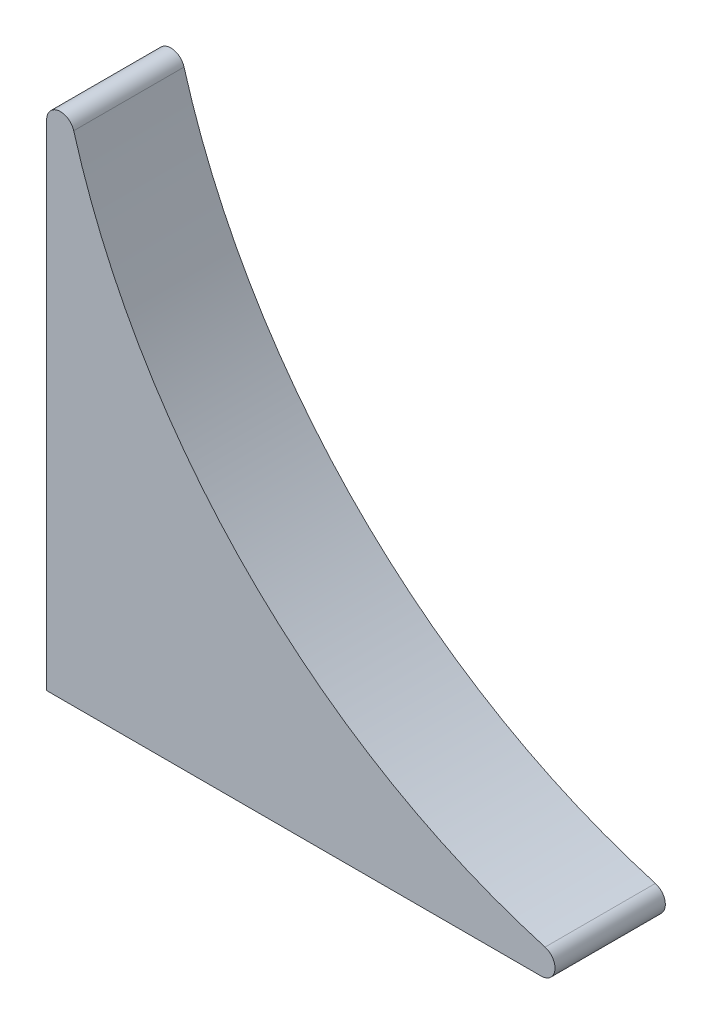
ISO-10303-21;
HEADER;
FILE_DESCRIPTION(('STEP AP214'),'2;1');
FILE_NAME('part.step','',(''),(''),'','','');
FILE_SCHEMA(('AUTOMOTIVE_DESIGN { 1 0 10303 214 1 1 1 1 }'));
ENDSEC;
DATA;
#1=APPLICATION_CONTEXT('core data for automotive mechanical design processes');
#2=APPLICATION_PROTOCOL_DEFINITION('international standard','automotive_design',2000,#1);
#3=PRODUCT_CONTEXT('',#1,'mechanical');
#4=PRODUCT('Part','Part','',(#3));
#5=PRODUCT_RELATED_PRODUCT_CATEGORY('part','',(#4));
#6=PRODUCT_DEFINITION_FORMATION('','',#4);
#7=PRODUCT_DEFINITION_CONTEXT('part definition',#1,'design');
#8=PRODUCT_DEFINITION('design','',#6,#7);
#9=PRODUCT_DEFINITION_SHAPE('','',#8);
#10=(LENGTH_UNIT() NAMED_UNIT(*) SI_UNIT(.MILLI.,.METRE.));
#11=(NAMED_UNIT(*) PLANE_ANGLE_UNIT() SI_UNIT($,.RADIAN.));
#12=(NAMED_UNIT(*) SI_UNIT($,.STERADIAN.) SOLID_ANGLE_UNIT());
#13=UNCERTAINTY_MEASURE_WITH_UNIT(LENGTH_MEASURE(1.E-05),#10,'distance_accuracy_value','');
#14=(GEOMETRIC_REPRESENTATION_CONTEXT(3) GLOBAL_UNCERTAINTY_ASSIGNED_CONTEXT((#13)) GLOBAL_UNIT_ASSIGNED_CONTEXT((#10,
#11,#12)) REPRESENTATION_CONTEXT('',''));
#15=CARTESIAN_POINT('',(0.,0.,0.));
#16=DIRECTION('',(0.,0.,1.));
#17=DIRECTION('',(1.,0.,0.));
#18=AXIS2_PLACEMENT_3D('',#15,#16,#17);
#19=CARTESIAN_POINT('',(0.,0.,4.));
#20=DIRECTION('',(1.,0.,0.));
#21=DIRECTION('',(0.,0.,-1.));
#22=AXIS2_PLACEMENT_3D('',#19,#20,#21);
#23=PLANE('',#22);
#24=DIRECTION('',(0.,-1.,0.));
#25=VECTOR('',#24,1.);
#26=CARTESIAN_POINT('',(0.,0.,4.));
#27=LINE('',#26,#25);
#28=CARTESIAN_POINT('',(0.,17.9289321881345,4.));
#29=VERTEX_POINT('',#28);
#30=CARTESIAN_POINT('',(0.,0.,4.));
#31=VERTEX_POINT('',#30);
#32=EDGE_CURVE('E82',#29,#31,#27,.T.);
#33=ORIENTED_EDGE('',*,*,#32,.F.);
#34=DIRECTION('',(0.,0.,-1.));
#35=VECTOR('',#34,1.);
#36=CARTESIAN_POINT('',(0.,17.9289321881345,4.));
#37=LINE('',#36,#35);
#38=CARTESIAN_POINT('',(0.,17.9289321881345,0.));
#39=VERTEX_POINT('',#38);
#40=EDGE_CURVE('E11',#29,#39,#37,.T.);
#41=ORIENTED_EDGE('',*,*,#40,.T.);
#42=DIRECTION('',(0.,-1.,0.));
#43=VECTOR('',#42,1.);
#44=CARTESIAN_POINT('',(0.,0.,0.));
#45=LINE('',#44,#43);
#46=CARTESIAN_POINT('',(0.,0.,0.));
#47=VERTEX_POINT('',#46);
#48=EDGE_CURVE('E97',#39,#47,#45,.T.);
#49=ORIENTED_EDGE('',*,*,#48,.T.);
#50=DIRECTION('',(0.,0.,-1.));
#51=VECTOR('',#50,1.);
#52=CARTESIAN_POINT('',(0.,0.,4.));
#53=LINE('',#52,#51);
#54=EDGE_CURVE('E93',#31,#47,#53,.T.);
#55=ORIENTED_EDGE('',*,*,#54,.F.);
#56=EDGE_LOOP('',(#33,#41,#49,#55));
#57=FACE_BOUND('',#56,.T.);
#58=ADVANCED_FACE('F35',(#57),#23,.F.);
#59=CARTESIAN_POINT('',(0.,0.,4.));
#60=DIRECTION('',(0.,1.,0.));
#61=DIRECTION('',(-1.,0.,0.));
#62=AXIS2_PLACEMENT_3D('',#59,#60,#61);
#63=PLANE('',#62);
#64=DIRECTION('',(1.,0.,0.));
#65=VECTOR('',#64,1.);
#66=CARTESIAN_POINT('',(0.,0.,0.));
#67=LINE('',#66,#65);
#68=CARTESIAN_POINT('',(17.9289321881345,0.,0.));
#69=VERTEX_POINT('',#68);
#70=EDGE_CURVE('E125',#47,#69,#67,.T.);
#71=ORIENTED_EDGE('',*,*,#70,.T.);
#72=DIRECTION('',(0.,0.,-1.));
#73=VECTOR('',#72,1.);
#74=CARTESIAN_POINT('',(17.9289321881345,0.,4.));
#75=LINE('',#74,#73);
#76=CARTESIAN_POINT('',(17.9289321881345,0.,4.));
#77=VERTEX_POINT('',#76);
#78=EDGE_CURVE('E58',#69,#77,#75,.F.);
#79=ORIENTED_EDGE('',*,*,#78,.T.);
#80=DIRECTION('',(1.,0.,0.));
#81=VECTOR('',#80,1.);
#82=CARTESIAN_POINT('',(0.,0.,4.));
#83=LINE('',#82,#81);
#84=EDGE_CURVE('E84',#31,#77,#83,.T.);
#85=ORIENTED_EDGE('',*,*,#84,.F.);
#86=ORIENTED_EDGE('',*,*,#54,.T.);
#87=EDGE_LOOP('',(#71,#79,#85,#86));
#88=FACE_BOUND('',#87,.T.);
#89=ADVANCED_FACE('F92',(#88),#63,.F.);
#90=CARTESIAN_POINT('',(25.,25.,4.));
#91=DIRECTION('',(0.,0.,-1.));
#92=DIRECTION('',(-1.,0.,0.));
#93=AXIS2_PLACEMENT_3D('',#90,#91,#92);
#94=CYLINDRICAL_SURFACE('',#93,25.);
#95=CARTESIAN_POINT('',(25.,25.,4.));
#96=DIRECTION('',(0.,0.,-1.));
#97=DIRECTION('',(1.,0.,0.));
#98=AXIS2_PLACEMENT_3D('',#95,#96,#97);
#99=CIRCLE('',#98,25.);
#100=CARTESIAN_POINT('',(18.0675805766025,0.980392156862745,4.));
#101=VERTEX_POINT('',#100);
#102=CARTESIAN_POINT('',(0.980392156862745,18.0675805766025,4.));
#103=VERTEX_POINT('',#102);
#104=EDGE_CURVE('E94',#101,#103,#99,.T.);
#105=ORIENTED_EDGE('',*,*,#104,.F.);
#106=DIRECTION('',(0.,0.,-1.));
#107=VECTOR('',#106,1.);
#108=CARTESIAN_POINT('',(18.0675805766025,0.980392156862745,4.));
#109=LINE('',#108,#107);
#110=CARTESIAN_POINT('',(18.0675805766025,0.980392156862745,0.));
#111=VERTEX_POINT('',#110);
#112=EDGE_CURVE('E101',#101,#111,#109,.T.);
#113=ORIENTED_EDGE('',*,*,#112,.T.);
#114=CARTESIAN_POINT('',(25.,25.,0.));
#115=DIRECTION('',(0.,0.,-1.));
#116=DIRECTION('',(1.,0.,0.));
#117=AXIS2_PLACEMENT_3D('',#114,#115,#116);
#118=CIRCLE('',#117,25.);
#119=CARTESIAN_POINT('',(0.980392156862745,18.0675805766025,0.));
#120=VERTEX_POINT('',#119);
#121=EDGE_CURVE('E89',#111,#120,#118,.T.);
#122=ORIENTED_EDGE('',*,*,#121,.T.);
#123=DIRECTION('',(0.,0.,-1.));
#124=VECTOR('',#123,1.);
#125=CARTESIAN_POINT('',(0.980392156862745,18.0675805766025,4.));
#126=LINE('',#125,#124);
#127=EDGE_CURVE('E99',#120,#103,#126,.F.);
#128=ORIENTED_EDGE('',*,*,#127,.T.);
#129=EDGE_LOOP('',(#105,#113,#122,#128));
#130=FACE_BOUND('',#129,.T.);
#131=ADVANCED_FACE('F118',(#130),#94,.F.);
#132=CARTESIAN_POINT('',(25.,25.,4.));
#133=DIRECTION('',(0.,0.,1.));
#134=DIRECTION('',(1.,0.,0.));
#135=AXIS2_PLACEMENT_3D('',#132,#133,#134);
#136=PLANE('',#135);
#137=ORIENTED_EDGE('',*,*,#84,.T.);
#138=CARTESIAN_POINT('',(17.9289321881345,0.5,4.));
#139=DIRECTION('',(0.,0.,1.));
#140=DIRECTION('',(1.,0.,0.));
#141=AXIS2_PLACEMENT_3D('',#138,#139,#140);
#142=CIRCLE('',#141,0.5);
#143=EDGE_CURVE('E43',#77,#101,#142,.T.);
#144=ORIENTED_EDGE('',*,*,#143,.T.);
#145=ORIENTED_EDGE('',*,*,#104,.T.);
#146=CARTESIAN_POINT('',(0.5,17.9289321881345,4.));
#147=DIRECTION('',(0.,0.,1.));
#148=DIRECTION('',(1.,0.,0.));
#149=AXIS2_PLACEMENT_3D('',#146,#147,#148);
#150=CIRCLE('',#149,0.5);
#151=EDGE_CURVE('E50',#103,#29,#150,.T.);
#152=ORIENTED_EDGE('',*,*,#151,.T.);
#153=ORIENTED_EDGE('',*,*,#32,.T.);
#154=EDGE_LOOP('',(#137,#144,#145,#152,#153));
#155=FACE_BOUND('',#154,.T.);
#156=ADVANCED_FACE('F83',(#155),#136,.T.);
#157=CARTESIAN_POINT('',(25.,25.,0.));
#158=DIRECTION('',(0.,0.,1.));
#159=DIRECTION('',(1.,0.,0.));
#160=AXIS2_PLACEMENT_3D('',#157,#158,#159);
#161=PLANE('',#160);
#162=ORIENTED_EDGE('',*,*,#121,.F.);
#163=CARTESIAN_POINT('',(17.9289321881345,0.5,0.));
#164=DIRECTION('',(0.,0.,1.));
#165=DIRECTION('',(1.,0.,0.));
#166=AXIS2_PLACEMENT_3D('',#163,#164,#165);
#167=CIRCLE('',#166,0.5);
#168=EDGE_CURVE('E111',#111,#69,#167,.F.);
#169=ORIENTED_EDGE('',*,*,#168,.T.);
#170=ORIENTED_EDGE('',*,*,#70,.F.);
#171=ORIENTED_EDGE('',*,*,#48,.F.);
#172=CARTESIAN_POINT('',(0.5,17.9289321881345,0.));
#173=DIRECTION('',(0.,0.,1.));
#174=DIRECTION('',(1.,0.,0.));
#175=AXIS2_PLACEMENT_3D('',#172,#173,#174);
#176=CIRCLE('',#175,0.5);
#177=EDGE_CURVE('E109',#39,#120,#176,.F.);
#178=ORIENTED_EDGE('',*,*,#177,.T.);
#179=EDGE_LOOP('',(#162,#169,#170,#171,#178));
#180=FACE_BOUND('',#179,.T.);
#181=ADVANCED_FACE('F124',(#180),#161,.F.);
#182=CARTESIAN_POINT('',(17.9289321881345,0.5,4.));
#183=DIRECTION('',(0.,0.,-1.));
#184=DIRECTION('',(-1.,0.,0.));
#185=AXIS2_PLACEMENT_3D('',#182,#183,#184);
#186=CYLINDRICAL_SURFACE('',#185,0.5);
#187=ORIENTED_EDGE('',*,*,#143,.F.);
#188=ORIENTED_EDGE('',*,*,#78,.F.);
#189=ORIENTED_EDGE('',*,*,#168,.F.);
#190=ORIENTED_EDGE('',*,*,#112,.F.);
#191=EDGE_LOOP('',(#187,#188,#189,#190));
#192=FACE_BOUND('',#191,.T.);
#193=ADVANCED_FACE('F122',(#192),#186,.T.);
#194=CARTESIAN_POINT('',(0.5,17.9289321881345,4.));
#195=DIRECTION('',(0.,0.,-1.));
#196=DIRECTION('',(-1.,0.,0.));
#197=AXIS2_PLACEMENT_3D('',#194,#195,#196);
#198=CYLINDRICAL_SURFACE('',#197,0.5);
#199=ORIENTED_EDGE('',*,*,#151,.F.);
#200=ORIENTED_EDGE('',*,*,#127,.F.);
#201=ORIENTED_EDGE('',*,*,#177,.F.);
#202=ORIENTED_EDGE('',*,*,#40,.F.);
#203=EDGE_LOOP('',(#199,#200,#201,#202));
#204=FACE_BOUND('',#203,.T.);
#205=ADVANCED_FACE('F37',(#204),#198,.T.);
#206=CLOSED_SHELL('',(#58,#89,#131,#156,#181,#193,#205));
#207=MANIFOLD_SOLID_BREP('B2',#206);
#208=ADVANCED_BREP_SHAPE_REPRESENTATION('',(#18,#207),#14);
#209=SHAPE_DEFINITION_REPRESENTATION(#9,#208);
ENDSEC;
END-ISO-10303-21;
